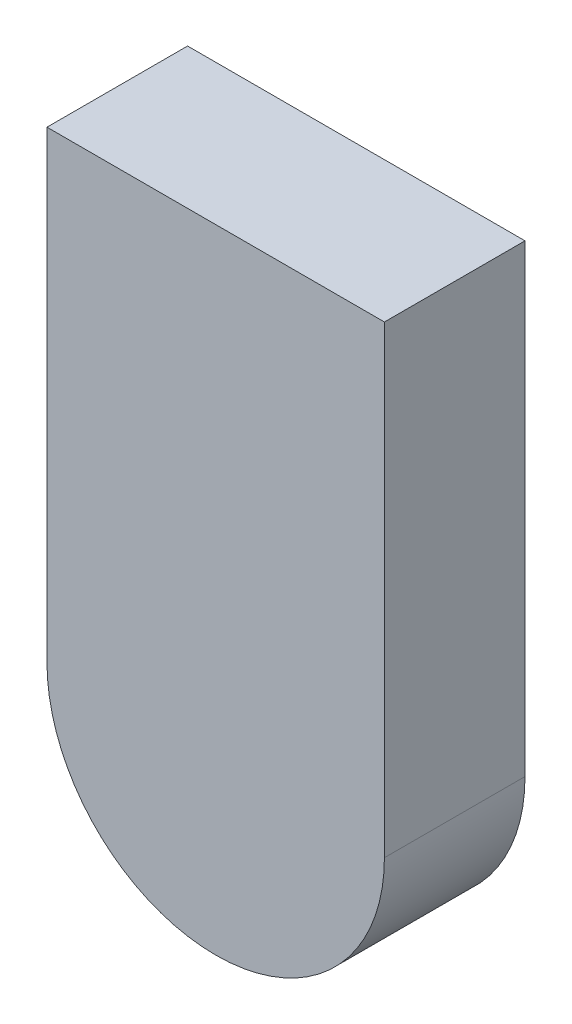
ISO-10303-21;
HEADER;
FILE_DESCRIPTION(('STEP AP214'),'2;1');
FILE_NAME('part.step','',(''),(''),'','','');
FILE_SCHEMA(('AUTOMOTIVE_DESIGN { 1 0 10303 214 1 1 1 1 }'));
ENDSEC;
DATA;
#1=APPLICATION_CONTEXT('core data for automotive mechanical design processes');
#2=APPLICATION_PROTOCOL_DEFINITION('international standard','automotive_design',2000,#1);
#3=PRODUCT_CONTEXT('',#1,'mechanical');
#4=PRODUCT('Part','Part','',(#3));
#5=PRODUCT_RELATED_PRODUCT_CATEGORY('part','',(#4));
#6=PRODUCT_DEFINITION_FORMATION('','',#4);
#7=PRODUCT_DEFINITION_CONTEXT('part definition',#1,'design');
#8=PRODUCT_DEFINITION('design','',#6,#7);
#9=PRODUCT_DEFINITION_SHAPE('','',#8);
#10=(LENGTH_UNIT() NAMED_UNIT(*) SI_UNIT(.MILLI.,.METRE.));
#11=(NAMED_UNIT(*) PLANE_ANGLE_UNIT() SI_UNIT($,.RADIAN.));
#12=(NAMED_UNIT(*) SI_UNIT($,.STERADIAN.) SOLID_ANGLE_UNIT());
#13=UNCERTAINTY_MEASURE_WITH_UNIT(LENGTH_MEASURE(1.E-05),#10,'distance_accuracy_value','');
#14=(GEOMETRIC_REPRESENTATION_CONTEXT(3) GLOBAL_UNCERTAINTY_ASSIGNED_CONTEXT((#13)) GLOBAL_UNIT_ASSIGNED_CONTEXT((#10,
#11,#12)) REPRESENTATION_CONTEXT('',''));
#15=CARTESIAN_POINT('',(0.,0.,0.));
#16=DIRECTION('',(0.,0.,1.));
#17=DIRECTION('',(1.,0.,0.));
#18=AXIS2_PLACEMENT_3D('',#15,#16,#17);
#19=CARTESIAN_POINT('',(-2.87,4.05,0.));
#20=DIRECTION('',(0.,1.,0.));
#21=DIRECTION('',(1.,0.,0.));
#22=AXIS2_PLACEMENT_3D('',#19,#20,#21);
#23=PLANE('',#22);
#24=DIRECTION('',(0.,0.,1.));
#25=VECTOR('',#24,1.);
#26=CARTESIAN_POINT('',(-2.87,4.05,0.));
#27=LINE('',#26,#25);
#28=CARTESIAN_POINT('',(-2.87,4.05,0.));
#29=VERTEX_POINT('',#28);
#30=CARTESIAN_POINT('',(-2.87,4.05,0.1));
#31=VERTEX_POINT('',#30);
#32=EDGE_CURVE('E11',#29,#31,#27,.T.);
#33=ORIENTED_EDGE('',*,*,#32,.T.);
#34=DIRECTION('',(1.,0.,0.));
#35=VECTOR('',#34,1.);
#36=CARTESIAN_POINT('',(-2.87,4.05,0.1));
#37=LINE('',#36,#35);
#38=CARTESIAN_POINT('',(-2.63,4.05,0.1));
#39=VERTEX_POINT('',#38);
#40=EDGE_CURVE('E24',#31,#39,#37,.T.);
#41=ORIENTED_EDGE('',*,*,#40,.T.);
#42=DIRECTION('',(0.,0.,1.));
#43=VECTOR('',#42,1.);
#44=CARTESIAN_POINT('',(-2.63,4.05,0.));
#45=LINE('',#44,#43);
#46=CARTESIAN_POINT('',(-2.63,4.05,0.));
#47=VERTEX_POINT('',#46);
#48=EDGE_CURVE('E85',#47,#39,#45,.T.);
#49=ORIENTED_EDGE('',*,*,#48,.F.);
#50=DIRECTION('',(1.,0.,0.));
#51=VECTOR('',#50,1.);
#52=CARTESIAN_POINT('',(-2.87,4.05,0.));
#53=LINE('',#52,#51);
#54=EDGE_CURVE('E82',#29,#47,#53,.T.);
#55=ORIENTED_EDGE('',*,*,#54,.F.);
#56=EDGE_LOOP('',(#33,#41,#49,#55));
#57=FACE_BOUND('',#56,.T.);
#58=ADVANCED_FACE('F17',(#57),#23,.T.);
#59=CARTESIAN_POINT('',(-2.63,4.05,0.));
#60=DIRECTION('',(1.,0.,0.));
#61=DIRECTION('',(0.,-1.,0.));
#62=AXIS2_PLACEMENT_3D('',#59,#60,#61);
#63=PLANE('',#62);
#64=ORIENTED_EDGE('',*,*,#48,.T.);
#65=DIRECTION('',(0.,-1.,0.));
#66=VECTOR('',#65,1.);
#67=CARTESIAN_POINT('',(-2.63,4.05,0.1));
#68=LINE('',#67,#66);
#69=CARTESIAN_POINT('',(-2.63,3.72,0.1));
#70=VERTEX_POINT('',#69);
#71=EDGE_CURVE('E80',#39,#70,#68,.T.);
#72=ORIENTED_EDGE('',*,*,#71,.T.);
#73=DIRECTION('',(0.,0.,1.));
#74=VECTOR('',#73,1.);
#75=CARTESIAN_POINT('',(-2.63,3.72,0.));
#76=LINE('',#75,#74);
#77=CARTESIAN_POINT('',(-2.63,3.72,0.));
#78=VERTEX_POINT('',#77);
#79=EDGE_CURVE('E60',#78,#70,#76,.T.);
#80=ORIENTED_EDGE('',*,*,#79,.F.);
#81=DIRECTION('',(0.,-1.,0.));
#82=VECTOR('',#81,1.);
#83=CARTESIAN_POINT('',(-2.63,4.05,0.));
#84=LINE('',#83,#82);
#85=EDGE_CURVE('E76',#47,#78,#84,.T.);
#86=ORIENTED_EDGE('',*,*,#85,.F.);
#87=EDGE_LOOP('',(#64,#72,#80,#86));
#88=FACE_BOUND('',#87,.T.);
#89=ADVANCED_FACE('F89',(#88),#63,.T.);
#90=CARTESIAN_POINT('',(-2.75,3.72,0.));
#91=DIRECTION('',(0.,0.,-1.));
#92=DIRECTION('',(1.,0.,0.));
#93=AXIS2_PLACEMENT_3D('',#90,#91,#92);
#94=CYLINDRICAL_SURFACE('',#93,0.12);
#95=CARTESIAN_POINT('',(-2.75,3.72,0.));
#96=DIRECTION('',(0.,0.,1.));
#97=DIRECTION('',(1.,0.,0.));
#98=AXIS2_PLACEMENT_3D('',#95,#96,#97);
#99=CIRCLE('',#98,0.12);
#100=CARTESIAN_POINT('',(-2.87,3.72,0.));
#101=VERTEX_POINT('',#100);
#102=EDGE_CURVE('E64',#101,#78,#99,.T.);
#103=ORIENTED_EDGE('',*,*,#102,.T.);
#104=ORIENTED_EDGE('',*,*,#79,.T.);
#105=CARTESIAN_POINT('',(-2.75,3.72,0.1));
#106=DIRECTION('',(0.,0.,1.));
#107=DIRECTION('',(1.,0.,0.));
#108=AXIS2_PLACEMENT_3D('',#105,#106,#107);
#109=CIRCLE('',#108,0.12);
#110=CARTESIAN_POINT('',(-2.87,3.72,0.1));
#111=VERTEX_POINT('',#110);
#112=EDGE_CURVE('E55',#111,#70,#109,.T.);
#113=ORIENTED_EDGE('',*,*,#112,.F.);
#114=DIRECTION('',(0.,0.,1.));
#115=VECTOR('',#114,1.);
#116=CARTESIAN_POINT('',(-2.87,3.72,0.));
#117=LINE('',#116,#115);
#118=EDGE_CURVE('E59',#101,#111,#117,.T.);
#119=ORIENTED_EDGE('',*,*,#118,.F.);
#120=EDGE_LOOP('',(#103,#104,#113,#119));
#121=FACE_BOUND('',#120,.T.);
#122=ADVANCED_FACE('F58',(#121),#94,.T.);
#123=CARTESIAN_POINT('',(-2.87,4.05,0.));
#124=DIRECTION('',(1.,0.,0.));
#125=DIRECTION('',(0.,-1.,0.));
#126=AXIS2_PLACEMENT_3D('',#123,#124,#125);
#127=PLANE('',#126);
#128=DIRECTION('',(0.,-1.,0.));
#129=VECTOR('',#128,1.);
#130=CARTESIAN_POINT('',(-2.87,4.05,0.));
#131=LINE('',#130,#129);
#132=EDGE_CURVE('E69',#29,#101,#131,.T.);
#133=ORIENTED_EDGE('',*,*,#132,.T.);
#134=ORIENTED_EDGE('',*,*,#118,.T.);
#135=DIRECTION('',(0.,-1.,0.));
#136=VECTOR('',#135,1.);
#137=CARTESIAN_POINT('',(-2.87,4.05,0.1));
#138=LINE('',#137,#136);
#139=EDGE_CURVE('E67',#31,#111,#138,.T.);
#140=ORIENTED_EDGE('',*,*,#139,.F.);
#141=ORIENTED_EDGE('',*,*,#32,.F.);
#142=EDGE_LOOP('',(#133,#134,#140,#141));
#143=FACE_BOUND('',#142,.T.);
#144=ADVANCED_FACE('F66',(#143),#127,.F.);
#145=CARTESIAN_POINT('',(-2.75,3.849490847913,0.));
#146=DIRECTION('',(0.,0.,-1.));
#147=DIRECTION('',(-1.,0.,0.));
#148=AXIS2_PLACEMENT_3D('',#145,#146,#147);
#149=PLANE('',#148);
#150=ORIENTED_EDGE('',*,*,#54,.T.);
#151=ORIENTED_EDGE('',*,*,#85,.T.);
#152=ORIENTED_EDGE('',*,*,#102,.F.);
#153=ORIENTED_EDGE('',*,*,#132,.F.);
#154=EDGE_LOOP('',(#150,#151,#152,#153));
#155=FACE_BOUND('',#154,.T.);
#156=ADVANCED_FACE('F91',(#155),#149,.T.);
#157=CARTESIAN_POINT('',(-2.75,3.849490847913,0.1));
#158=DIRECTION('',(0.,0.,-1.));
#159=DIRECTION('',(-1.,0.,0.));
#160=AXIS2_PLACEMENT_3D('',#157,#158,#159);
#161=PLANE('',#160);
#162=ORIENTED_EDGE('',*,*,#139,.T.);
#163=ORIENTED_EDGE('',*,*,#112,.T.);
#164=ORIENTED_EDGE('',*,*,#71,.F.);
#165=ORIENTED_EDGE('',*,*,#40,.F.);
#166=EDGE_LOOP('',(#162,#163,#164,#165));
#167=FACE_BOUND('',#166,.T.);
#168=ADVANCED_FACE('F71',(#167),#161,.F.);
#169=CLOSED_SHELL('',(#58,#89,#122,#144,#156,#168));
#170=MANIFOLD_SOLID_BREP('B1',#169);
#171=ADVANCED_BREP_SHAPE_REPRESENTATION('',(#18,#170),#14);
#172=SHAPE_DEFINITION_REPRESENTATION(#9,#171);
ENDSEC;
END-ISO-10303-21;
